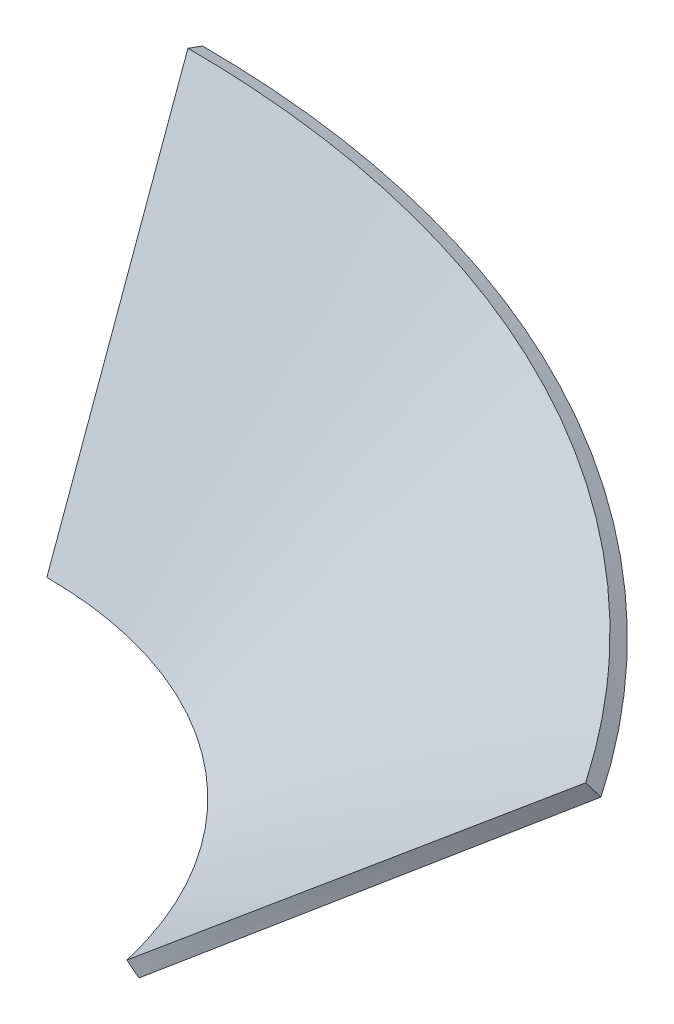
ISO-10303-21;
HEADER;
FILE_DESCRIPTION(('STEP AP214'),'2;1');
FILE_NAME('part.step','',(''),(''),'','','');
FILE_SCHEMA(('AUTOMOTIVE_DESIGN { 1 0 10303 214 1 1 1 1 }'));
ENDSEC;
DATA;
#1=APPLICATION_CONTEXT('core data for automotive mechanical design processes');
#2=APPLICATION_PROTOCOL_DEFINITION('international standard','automotive_design',2000,#1);
#3=PRODUCT_CONTEXT('',#1,'mechanical');
#4=PRODUCT('Part','Part','',(#3));
#5=PRODUCT_RELATED_PRODUCT_CATEGORY('part','',(#4));
#6=PRODUCT_DEFINITION_FORMATION('','',#4);
#7=PRODUCT_DEFINITION_CONTEXT('part definition',#1,'design');
#8=PRODUCT_DEFINITION('design','',#6,#7);
#9=PRODUCT_DEFINITION_SHAPE('','',#8);
#10=(LENGTH_UNIT() NAMED_UNIT(*) SI_UNIT(.MILLI.,.METRE.));
#11=(NAMED_UNIT(*) PLANE_ANGLE_UNIT() SI_UNIT($,.RADIAN.));
#12=(NAMED_UNIT(*) SI_UNIT($,.STERADIAN.) SOLID_ANGLE_UNIT());
#13=UNCERTAINTY_MEASURE_WITH_UNIT(LENGTH_MEASURE(1.E-05),#10,'distance_accuracy_value','');
#14=(GEOMETRIC_REPRESENTATION_CONTEXT(3) GLOBAL_UNCERTAINTY_ASSIGNED_CONTEXT((#13)) GLOBAL_UNIT_ASSIGNED_CONTEXT((#10,
#11,#12)) REPRESENTATION_CONTEXT('',''));
#15=CARTESIAN_POINT('',(0.,0.,0.));
#16=DIRECTION('',(0.,0.,1.));
#17=DIRECTION('',(1.,0.,0.));
#18=AXIS2_PLACEMENT_3D('',#15,#16,#17);
#19=CARTESIAN_POINT('',(0.,50.6840402866513,-16.3191264717385));
#20=CARTESIAN_POINT('',(10.8249010336155,50.6840402866513,-16.3191264717385));
#21=CARTESIAN_POINT('',(21.4731444882357,50.7087398383172,-14.98420988039));
#22=CARTESIAN_POINT('',(42.0120517760367,50.7974050081395,-9.86590466604726));
#23=CARTESIAN_POINT('',(51.9027896338999,50.8611717021922,-6.08275534195021));
#24=CARTESIAN_POINT('',(70.5197720273292,51.008107385866,3.71618677035024));
#25=CARTESIAN_POINT('',(79.2463289842847,51.0909703596056,9.73194356780101));
#26=CARTESIAN_POINT('',(95.1198683638577,51.2540069229055,23.7920880772626));
#27=CARTESIAN_POINT('',(102.266838470099,51.3338990721079,31.8367740876005));
#28=CARTESIAN_POINT('',(108.408596103571,51.4051770282457,40.7970191702065));
#29=CARTESIAN_POINT('',(0.,50.,-18.1985117133104));
#30=CARTESIAN_POINT('',(10.9805005193952,50.,-18.1985117133104));
#31=CARTESIAN_POINT('',(21.7826504128399,50.,-16.8353798673282));
#32=CARTESIAN_POINT('',(42.6047021804095,50.,-11.6088467613317));
#33=CARTESIAN_POINT('',(52.6246040545343,50.,-7.74544550131745));
#34=CARTESIAN_POINT('',(71.4566130160449,50.,2.25563215481074));
#35=CARTESIAN_POINT('',(80.2687201034307,50.,8.39330855092469));
#36=CARTESIAN_POINT('',(96.2595927240442,50.,22.7169422013199));
#37=CARTESIAN_POINT('',(103.438358257272,50.,30.9028994556012));
#38=CARTESIAN_POINT('',(109.587679629711,50.,40.));
#39=B_SPLINE_SURFACE_WITH_KNOTS('',1,3,((#19,#20,#21,#22,#23,#24,#25,#26,#27,#28),(#29,#30,#31,
#32,#33,#34,#35,#36,#37,#38)),.UNSPECIFIED.,.F.,.F.,.F.,(2,2),(4,2,2,2,4),(0.,1.),(0.,0.25,0.5,
0.75,1.),.UNSPECIFIED.);
#40=CARTESIAN_POINT('',(109.587679629711,50.,40.));
#41=CARTESIAN_POINT('',(108.408596103571,51.4051770282457,40.7970191702065));
#42=B_SPLINE_CURVE_WITH_KNOTS('',1,(#40,#41),.UNSPECIFIED.,.F.,.F.,(2,2),(0.,1.),.UNSPECIFIED.);
#43=CARTESIAN_POINT('',(109.587679629711,50.,40.));
#44=VERTEX_POINT('',#43);
#45=CARTESIAN_POINT('',(108.408596103571,51.4051770282457,40.7970191702065));
#46=VERTEX_POINT('',#45);
#47=EDGE_CURVE('E14',#44,#46,#42,.T.);
#48=CARTESIAN_POINT('',(109.587679629711,50.,40.));
#49=CARTESIAN_POINT('',(103.438358257272,50.,30.9028994556012));
#50=CARTESIAN_POINT('',(96.2595927240442,50.,22.7169422013199));
#51=CARTESIAN_POINT('',(80.2687201034307,50.,8.39330855092469));
#52=CARTESIAN_POINT('',(71.4566130160449,50.,2.25563215481074));
#53=CARTESIAN_POINT('',(52.6246040545343,50.,-7.74544550131745));
#54=CARTESIAN_POINT('',(42.6047021804095,50.,-11.6088467613317));
#55=CARTESIAN_POINT('',(21.7826504128399,50.,-16.8353798673282));
#56=CARTESIAN_POINT('',(10.9805005193952,50.,-18.1985117133104));
#57=CARTESIAN_POINT('',(0.,50.,-18.1985117133104));
#58=B_SPLINE_CURVE_WITH_KNOTS('',3,(#48,#49,#50,#51,#52,#53,#54,#55,#56,#57),.UNSPECIFIED.,.F.,
.F.,(4,2,2,2,4),(0.,0.25,0.5,0.75,1.),.UNSPECIFIED.);
#59=CARTESIAN_POINT('',(0.,50.,-18.1985117133104));
#60=VERTEX_POINT('',#59);
#61=EDGE_CURVE('E291',#44,#60,#58,.T.);
#62=CARTESIAN_POINT('',(0.,50.,-18.1985117133104));
#63=CARTESIAN_POINT('',(0.,50.6840402866513,-16.3191264717385));
#64=B_SPLINE_CURVE_WITH_KNOTS('',1,(#62,#63),.UNSPECIFIED.,.F.,.F.,(2,2),(0.,1.),.UNSPECIFIED.);
#65=CARTESIAN_POINT('',(0.,50.6840402866513,-16.3191264717385));
#66=VERTEX_POINT('',#65);
#67=EDGE_CURVE('E131',#60,#66,#64,.T.);
#68=CARTESIAN_POINT('',(108.408596103612,51.4051770282808,40.7970191702044));
#69=CARTESIAN_POINT('',(107.642493701793,51.3962866029761,39.6793294914557));
#70=CARTESIAN_POINT('',(106.859083840726,51.3872492616663,38.5735036334233));
#71=CARTESIAN_POINT('',(105.261549017149,51.3689368143863,36.3909415085314));
#72=CARTESIAN_POINT('',(104.447556978182,51.3596627833626,35.3141079361718));
#73=CARTESIAN_POINT('',(102.789714737203,51.340896683181,33.1899225499919));
#74=CARTESIAN_POINT('',(101.945982841247,51.3314055212837,32.1424783950681));
#75=CARTESIAN_POINT('',(100.22952635644,51.3122287816158,30.0774537208072));
#76=CARTESIAN_POINT('',(99.3569064601574,51.3025439475004,29.0597861721035));
#77=CARTESIAN_POINT('',(97.5835311517734,51.2830060847677,27.0546975675129));
#78=CARTESIAN_POINT('',(96.6828678444235,51.2731536468438,26.0671950435887));
#79=CARTESIAN_POINT('',(94.8542588839716,51.2533096212125,24.1228179908055));
#80=CARTESIAN_POINT('',(93.9263937128914,51.2433184825531,23.1658677656035));
#81=CARTESIAN_POINT('',(92.0442289178988,51.2232286864445,21.2829767485833));
#82=CARTESIAN_POINT('',(91.0899990726401,51.2131303495855,20.3569662000434));
#83=CARTESIAN_POINT('',(89.155947869647,51.1928602075425,18.5363362441779));
#84=CARTESIAN_POINT('',(88.1761864536979,51.182688609001,17.6416531569898));
#85=CARTESIAN_POINT('',(86.1919099552839,51.1623081785418,15.8840606001643));
#86=CARTESIAN_POINT('',(85.187445791534,51.1520994550204,15.0210936421963));
#87=CARTESIAN_POINT('',(83.1545970693339,51.131682937611,13.3273172492666));
#88=CARTESIAN_POINT('',(82.1262551664227,51.1214751705288,12.4964566176722));
#89=CARTESIAN_POINT('',(80.0464783808654,51.10110035692,10.8672778672928));
#90=CARTESIAN_POINT('',(78.9950786006728,51.0909332730472,10.0689149388153));
#91=CARTESIAN_POINT('',(76.8700132250174,51.0706809804754,8.50512091057467));
#92=CARTESIAN_POINT('',(75.796375831708,51.0605956882382,7.73965148084996));
#93=CARTESIAN_POINT('',(73.6276423665441,51.0405490129432,6.24202769694511));
#94=CARTESIAN_POINT('',(72.5325682245674,51.0305875187185,5.50984160575257));
#95=CARTESIAN_POINT('',(70.3218233686709,51.0108316253207,4.07920179827513));
#96=CARTESIAN_POINT('',(69.2061688300362,51.0010371056647,3.3807230304532));
#97=CARTESIAN_POINT('',(65.8301915424611,50.9719747857555,1.3368981721529));
#98=CARTESIAN_POINT('',(63.5390885778453,50.9530117778792,0.0419439207716497));
#99=CARTESIAN_POINT('',(58.8840036425009,50.9162714976767,-2.40823323566903));
#100=CARTESIAN_POINT('',(56.5200384015357,50.8984939560803,-3.56348792133414));
#101=CARTESIAN_POINT('',(52.9252660792756,50.8729745113279,-5.18878736742528));
#102=CARTESIAN_POINT('',(51.7185804032817,50.8646573451935,-5.71273447094463));
#103=CARTESIAN_POINT('',(49.2893701164254,50.8484428722183,-6.72452077306523));
#104=CARTESIAN_POINT('',(48.0668374837659,50.8405457892419,-7.21234077259512));
#105=CARTESIAN_POINT('',(45.6067775540441,50.8252109095451,-8.15143716497114));
#106=CARTESIAN_POINT('',(44.3692397299568,50.8177734606113,-8.60268596433854));
#107=CARTESIAN_POINT('',(41.8799532328885,50.8033951645828,-9.46823286127362));
#108=CARTESIAN_POINT('',(40.6281919079135,50.7964548075692,-9.88249458997304));
#109=CARTESIAN_POINT('',(38.1112568184473,50.7831063870632,-10.6736502369192));
#110=CARTESIAN_POINT('',(36.846068718649,50.7766989745819,-11.0504985589935));
#111=CARTESIAN_POINT('',(34.3030731208525,50.7644501407989,-11.7664110110048));
#112=CARTESIAN_POINT('',(33.0252500467428,50.7586095496136,-12.1054198303816));
#113=CARTESIAN_POINT('',(30.4577776207984,50.7475259352335,-12.7452351313866));
#114=CARTESIAN_POINT('',(29.1681119267897,50.7422839390502,-13.0459760547495));
#115=CARTESIAN_POINT('',(26.5777460184062,50.7324267881362,-13.6088367154021));
#116=CARTESIAN_POINT('',(25.2770292021316,50.7278128744439,-13.8708800737325));
#117=CARTESIAN_POINT('',(22.6653517803438,50.7192386948901,-14.3559261065373));
#118=CARTESIAN_POINT('',(21.3543748609262,50.7152799003261,-14.5788409707147));
#119=CARTESIAN_POINT('',(18.7229667232198,50.70804011845,-14.985210272498));
#120=CARTESIAN_POINT('',(17.4025200742151,50.7047608476546,-15.1685648254243));
#121=CARTESIAN_POINT('',(14.7529606243396,50.6989014768166,-15.4953933301446));
#122=CARTESIAN_POINT('',(13.4238339254265,50.6963233518649,-15.6387546517599));
#123=CARTESIAN_POINT('',(10.757700901943,50.6918845352134,-15.88517765159));
#124=CARTESIAN_POINT('',(9.42068292135157,50.6900260879934,-15.988113266898));
#125=CARTESIAN_POINT('',(6.73955231803689,50.6870420168321,-16.1532617329687));
#126=CARTESIAN_POINT('',(5.39543105693418,50.6859189161373,-16.215334371636));
#127=CARTESIAN_POINT('',(2.7008759843129,50.6844162184216,-16.2983495366273));
#128=CARTESIAN_POINT('',(1.35043739335836,50.6840394235203,-16.3191370524141));
#129=CARTESIAN_POINT('',(-2.92906408430304E-11,50.6840402866726,-16.3191264717463));
#130=B_SPLINE_CURVE_WITH_KNOTS('',3,(#68,#69,#70,#71,#72,#73,#74,#75,#76,#77,#78,#79,#80,#81,
#82,#83,#84,#85,#86,#87,#88,#89,#90,#91,#92,#93,#94,#95,#96,#97,#98,#99,#100,#101,#102,#103,
#104,#105,#106,#107,#108,#109,#110,#111,#112,#113,#114,#115,#116,#117,#118,#119,#120,#121,#122,
#123,#124,#125,#126,#127,#128,#129),.UNSPECIFIED.,.F.,.F.,(4,2,2,2,2,2,2,2,2,2,2,2,2,2,2,2,2,2,
2,2,2,2,2,2,2,2,2,2,2,2,4),(0.,4.06505632475749,8.11412446539964,12.1485856613322,
16.1697531644856,20.1788758898483,24.1771423312572,28.1656847185517,32.145583395111,
36.1178713955705,40.0835392020736,44.0435396626892,47.9987930496999,51.9501922412059,
55.8986080102557,63.7890098883885,71.6776133687218,75.6237799389633,79.5720287966563,
83.523229453428,87.4782734403303,91.4380797958748,95.4036004860255,99.375825735169,
103.355789245037,107.344573278378,111.343313581279,115.35320411797,119.375501590463,
123.41152971276,127.462683210241),.UNSPECIFIED.);
#131=EDGE_CURVE('E182',#46,#66,#130,.T.);
#132=ORIENTED_EDGE('',*,*,#47,.F.);
#133=ORIENTED_EDGE('',*,*,#61,.T.);
#134=ORIENTED_EDGE('',*,*,#67,.T.);
#135=ORIENTED_EDGE('',*,*,#131,.F.);
#136=EDGE_LOOP('',(#132,#133,#134,#135));
#137=FACE_BOUND('',#136,.T.);
#138=ADVANCED_FACE('F119',(#137),#39,.F.);
#139=CARTESIAN_POINT('',(0.,50.6840402866513,-16.3191264717385));
#140=DIRECTION('',(-1.,0.,0.));
#141=DIRECTION('',(0.,-0.342020143325672,-0.939692620785907));
#142=AXIS2_PLACEMENT_3D('',#139,#140,#141);
#143=PLANE('',#142);
#144=ORIENTED_EDGE('',*,*,#67,.F.);
#145=CARTESIAN_POINT('',(0.,0.,0.));
#146=CARTESIAN_POINT('',(0.,50.,-18.1985117133104));
#147=B_SPLINE_CURVE_WITH_KNOTS('',1,(#145,#146),.UNSPECIFIED.,.F.,.F.,(2,2),(0.,1.),.UNSPECIFIED.);
#148=CARTESIAN_POINT('',(0.,0.,0.));
#149=VERTEX_POINT('',#148);
#150=EDGE_CURVE('E165',#60,#149,#147,.F.);
#151=ORIENTED_EDGE('',*,*,#150,.T.);
#152=CARTESIAN_POINT('',(0.,0.684040286651346,1.87938524157181));
#153=CARTESIAN_POINT('',(0.,0.,0.));
#154=B_SPLINE_CURVE_WITH_KNOTS('',1,(#152,#153),.UNSPECIFIED.,.F.,.F.,(2,2),(0.,1.),.UNSPECIFIED.);
#155=CARTESIAN_POINT('',(0.,0.684040286651346,1.87938524157181));
#156=VERTEX_POINT('',#155);
#157=EDGE_CURVE('E161',#149,#156,#154,.F.);
#158=ORIENTED_EDGE('',*,*,#157,.T.);
#159=CARTESIAN_POINT('',(-2.92906408430304E-11,50.6840402866726,-16.3191264717463));
#160=CARTESIAN_POINT('',(2.43389383129165E-11,48.6007069533445,-15.5608551503602));
#161=CARTESIAN_POINT('',(3.00946519682249E-11,46.5173736200164,-14.8025838289742));
#162=CARTESIAN_POINT('',(8.0969746176071E-12,42.3507069533217,-13.2860411861882));
#163=CARTESIAN_POINT('',(-1.96564163889365E-11,40.2673736199553,-12.5277698647882));
#164=CARTESIAN_POINT('',(-4.64336767203023E-11,36.1007069532694,-11.0112272220053));
#165=CARTESIAN_POINT('',(-4.54575460457745E-11,34.01737361995,-10.2529559006225));
#166=CARTESIAN_POINT('',(-3.32725001383884E-11,29.8507069533043,-8.73641325785424));
#167=CARTESIAN_POINT('',(-2.20635849054959E-11,27.767373619978,-7.97814193646885));
#168=CARTESIAN_POINT('',(-1.58398329544504E-11,23.6007069533183,-6.46159929369553));
#169=CARTESIAN_POINT('',(-2.08249962363517E-11,21.517373619985,-5.7033279723076));
#170=CARTESIAN_POINT('',(-2.00858313777983E-11,17.3507069533218,-4.18678532953301));
#171=CARTESIAN_POINT('',(-1.43615032373615E-11,15.2673736199919,-3.42851400814635));
#172=CARTESIAN_POINT('',(-7.85680020585296E-12,11.1007069533253,-1.91197136537049));
#173=CARTESIAN_POINT('',(-7.07642531479777E-12,9.01737361998845,-1.15370004398128));
#174=CARTESIAN_POINT('',(-5.08042912703093E-12,4.85070695331819,0.362842598795886));
#175=CARTESIAN_POINT('',(-3.86480783031998E-12,2.76737361998477,1.12111392018385));
#176=CARTESIAN_POINT('',(2.58036496739734E-13,0.684040286651345,1.87938524157181));
#177=B_SPLINE_CURVE_WITH_KNOTS('',3,(#159,#160,#161,#162,#163,#164,#165,#166,#167,#168,#169,
#170,#171,#172,#173,#174,#175,#176),.UNSPECIFIED.,.F.,.F.,(4,2,2,2,2,2,2,2,4),(0.,
6.65111107795779,13.3022221560381,19.953333233968,26.6044443119202,33.2555553898946,
39.9066664678579,46.5577775458435,53.2088886238183),.UNSPECIFIED.);
#178=EDGE_CURVE('E164',#66,#156,#177,.T.);
#179=ORIENTED_EDGE('',*,*,#178,.F.);
#180=EDGE_LOOP('',(#144,#151,#158,#179));
#181=FACE_BOUND('',#180,.T.);
#182=ADVANCED_FACE('F121',(#181),#143,.T.);
#183=CARTESIAN_POINT('',(0.,0.684040286651346,1.87938524157181));
#184=CARTESIAN_POINT('',(5.77265199535576,0.684040286651346,1.87938524157181));
#185=CARTESIAN_POINT('',(11.3497534668203,0.720019055685617,2.86709290837386));
#186=CARTESIAN_POINT('',(21.7775940697326,0.843055199080425,6.52660243017407));
#187=CARTESIAN_POINT('',(26.628867837651,0.92920837619734,9.19847023848127));
#188=CARTESIAN_POINT('',(35.2483765429995,1.11223542366804,15.9549742857055));
#189=CARTESIAN_POINT('',(39.0167795586966,1.20831806684802,20.0402428612955));
#190=CARTESIAN_POINT('',(45.0811361582107,1.37980264049407,29.3647636380504));
#191=CARTESIAN_POINT('',(47.3763485009201,1.45514674117948,34.6044111629637));
#192=CARTESIAN_POINT('',(48.727662673858,1.5163125794214,40.2862758983819));
#193=CARTESIAN_POINT('',(0.,0.,0.));
#194=CARTESIAN_POINT('',(5.99031188382215,0.,0.));
#195=CARTESIAN_POINT('',(11.7817311979625,0.,1.03894832101899));
#196=CARTESIAN_POINT('',(22.581256584969,0.,4.88631912356645));
#197=CARTESIAN_POINT('',(27.5893626578351,0.,7.69474160509493));
#198=CARTESIAN_POINT('',(36.4367334603826,0.,14.7726382471329));
#199=CARTESIAN_POINT('',(40.2759981900639,0.,19.0421124076424));
#200=CARTESIAN_POINT('',(46.4001582043312,0.,28.7336899261139));
#201=CARTESIAN_POINT('',(48.6850534889171,0.,34.1557932840759));
#202=CARTESIAN_POINT('',(50.,0.,40.));
#203=B_SPLINE_SURFACE_WITH_KNOTS('',1,3,((#183,#184,#185,#186,#187,#188,#189,#190,#191,#192),
(#193,#194,#195,#196,#197,#198,#199,#200,#201,#202)),.UNSPECIFIED.,.F.,.F.,.F.,(2,2),(4,2,2,2,
4),(0.,1.),(0.,0.25,0.5,0.75,1.),.UNSPECIFIED.);
#204=CARTESIAN_POINT('',(0.,0.,0.));
#205=CARTESIAN_POINT('',(5.99031188382215,0.,0.));
#206=CARTESIAN_POINT('',(11.7817311979625,0.,1.03894832101899));
#207=CARTESIAN_POINT('',(22.581256584969,0.,4.88631912356645));
#208=CARTESIAN_POINT('',(27.5893626578351,0.,7.69474160509493));
#209=CARTESIAN_POINT('',(36.4367334603826,0.,14.7726382471329));
#210=CARTESIAN_POINT('',(40.2759981900639,0.,19.0421124076424));
#211=CARTESIAN_POINT('',(46.4001582043312,0.,28.7336899261139));
#212=CARTESIAN_POINT('',(48.6850534889171,0.,34.1557932840759));
#213=CARTESIAN_POINT('',(50.,0.,40.));
#214=B_SPLINE_CURVE_WITH_KNOTS('',3,(#204,#205,#206,#207,#208,#209,#210,#211,#212,#213),
.UNSPECIFIED.,.F.,.F.,(4,2,2,2,4),(0.,0.25,0.5,0.75,1.),.UNSPECIFIED.);
#215=CARTESIAN_POINT('',(50.,0.,40.));
#216=VERTEX_POINT('',#215);
#217=EDGE_CURVE('E184',#149,#216,#214,.T.);
#218=CARTESIAN_POINT('',(50.,0.,40.));
#219=CARTESIAN_POINT('',(48.727662673858,1.5163125794214,40.2862758983819));
#220=B_SPLINE_CURVE_WITH_KNOTS('',1,(#218,#219),.UNSPECIFIED.,.F.,.F.,(2,2),(0.,1.),.UNSPECIFIED.);
#221=CARTESIAN_POINT('',(48.727662673858,1.5163125794214,40.2862758983819));
#222=VERTEX_POINT('',#221);
#223=EDGE_CURVE('E172',#216,#222,#220,.T.);
#224=CARTESIAN_POINT('',(2.58036496739734E-13,0.684040286651345,1.87938524157181));
#225=CARTESIAN_POINT('',(0.718656127822375,0.684037843397547,1.8793665670023));
#226=CARTESIAN_POINT('',(1.43731764671445,0.684576075846765,1.894705938729));
#227=CARTESIAN_POINT('',(2.86783111001728,0.686729872183305,1.95592623401847));
#228=CARTESIAN_POINT('',(3.57969311060006,0.688337168384155,2.00157277003933));
#229=CARTESIAN_POINT('',(4.99596500150211,0.6926103332833,2.12281725651599));
#230=CARTESIAN_POINT('',(5.70039258938772,0.695268900396044,2.1982086068805));
#231=CARTESIAN_POINT('',(7.10114623671469,0.701613043925287,2.37833259999444));
#232=CARTESIAN_POINT('',(7.79749552468349,0.705292304870329,2.48288483259591));
#233=CARTESIAN_POINT('',(9.18144073896021,0.713638873681131,2.72073530391824));
#234=CARTESIAN_POINT('',(9.8690635371066,0.718300811552714,2.85387738003853));
#235=CARTESIAN_POINT('',(11.2348999280601,0.728565958815836,3.14831740540459));
#236=CARTESIAN_POINT('',(11.9131424088435,0.734164689415358,3.30948151883311));
#237=CARTESIAN_POINT('',(13.2595583830569,0.746249978961744,3.65938288300763));
#238=CARTESIAN_POINT('',(13.9277613902097,0.752732878954333,3.84800670362935));
#239=CARTESIAN_POINT('',(15.2534343440237,0.766527134727713,4.25225133349862));
#240=CARTESIAN_POINT('',(15.9109332582027,0.773835570580936,4.46777725738106));
#241=CARTESIAN_POINT('',(17.2145294066216,0.789216444961364,4.92525661104424));
#242=CARTESIAN_POINT('',(17.8606540821857,0.797286616392437,5.16713193087887));
#243=CARTESIAN_POINT('',(19.1408282707973,0.81412225095021,5.67674714213662));
#244=CARTESIAN_POINT('',(19.7749028815775,0.822886012040733,5.94442404949175));
#245=CARTESIAN_POINT('',(21.0302982497305,0.841036691927374,6.50508598513586));
#246=CARTESIAN_POINT('',(21.6516410748401,0.850422387183509,6.7980216447616));
#247=CARTESIAN_POINT('',(22.8808885925792,0.869742217650611,7.40865100116255));
#248=CARTESIAN_POINT('',(23.4888117351336,0.879675524461409,7.72630758558814));
#249=CARTESIAN_POINT('',(24.6905296196912,0.900014122509481,8.38583489908054));
#250=CARTESIAN_POINT('',(25.2843386723037,0.910418901607551,8.72767957018087));
#251=CARTESIAN_POINT('',(26.457131714502,0.931623101219513,9.43504509369393));
#252=CARTESIAN_POINT('',(27.0361253887745,0.942422252115419,9.80054989786066));
#253=CARTESIAN_POINT('',(28.1785842292162,0.964337812824795,10.5547032912769));
#254=CARTESIAN_POINT('',(28.7420539723663,0.975454127116863,10.9433449498319));
#255=CARTESIAN_POINT('',(29.8527543750948,0.997927431618464,11.7432447502487));
#256=CARTESIAN_POINT('',(30.3999839986306,1.00928443710407,12.1545043302718));
#257=CARTESIAN_POINT('',(31.4774861738852,1.03216415737444,12.9991171834383));
#258=CARTESIAN_POINT('',(32.0077515212097,1.04368693962724,13.4324796457704));
#259=CARTESIAN_POINT('',(33.050599548472,1.06682564705209,14.3207792959992));
#260=CARTESIAN_POINT('',(33.5631682259667,1.07844163740719,14.7757329212969));
#261=CARTESIAN_POINT('',(34.5698896234644,1.10169732829483,15.7066989722755));
#262=CARTESIAN_POINT('',(35.064020816796,1.11333704077922,16.1827346770496));
#263=CARTESIAN_POINT('',(36.0331262983066,1.13657454868265,17.1553511500712));
#264=CARTESIAN_POINT('',(36.5080706932989,1.14817225486531,17.6519617074673));
#265=CARTESIAN_POINT('',(37.4380541419327,1.17126452162816,18.665215433881));
#266=CARTESIAN_POINT('',(37.8930539606991,1.18275884639547,19.1818946213319));
#267=CARTESIAN_POINT('',(38.7823926392124,1.20558802500476,20.2347735163805));
#268=CARTESIAN_POINT('',(39.2166818007631,1.21692245339458,20.7710152153474));
#269=CARTESIAN_POINT('',(40.0638368059167,1.23938082263201,21.8625064841295));
#270=CARTESIAN_POINT('',(40.4766412102356,1.25050410761385,22.4178037574526));
#271=CARTESIAN_POINT('',(41.2800581674129,1.2724947812428,23.546892087397));
#272=CARTESIAN_POINT('',(41.6705961007857,1.28336124530213,24.1207362634522));
#273=CARTESIAN_POINT('',(42.4287060808266,1.30479866781562,25.2864020563772));
#274=CARTESIAN_POINT('',(42.7961887275109,1.3153683975102,25.8782818441472));
#275=CARTESIAN_POINT('',(43.5074093763234,1.33617862464765,27.0794995350841));
#276=CARTESIAN_POINT('',(43.8510414428657,1.34641755713818,27.6889001938408));
#277=CARTESIAN_POINT('',(44.5137782352475,1.36653832271125,28.924636707174));
#278=CARTESIAN_POINT('',(44.8327585930944,1.37641822675844,29.5510392984024));
#279=CARTESIAN_POINT('',(45.4454063887927,1.39579881771013,30.8202526518674));
#280=CARTESIAN_POINT('',(45.7389290099923,1.40529718858339,31.4631333572455));
#281=CARTESIAN_POINT('',(46.2998730670043,1.42389810704319,32.7647715332064));
#282=CARTESIAN_POINT('',(46.5671271264812,1.43299793426509,33.4236011764113));
#283=CARTESIAN_POINT('',(47.0747465643672,1.45079051061699,34.7566009324253));
#284=CARTESIAN_POINT('',(47.314919859075,1.45948012500437,35.4308442370887));
#285=CARTESIAN_POINT('',(47.7675821114079,1.47644556779066,36.7941311673602));
#286=CARTESIAN_POINT('',(47.9798520556126,1.48471784100715,37.4832475470028));
#287=CARTESIAN_POINT('',(48.3759413367439,1.500847778508,38.8757324862057));
#288=CARTESIAN_POINT('',(48.5595128403826,1.50870148219968,39.5791716019201));
#289=CARTESIAN_POINT('',(48.7276626739143,1.51631257947097,40.2862758983693));
#290=B_SPLINE_CURVE_WITH_KNOTS('',3,(#224,#225,#226,#227,#228,#229,#230,#231,#232,#233,#234,
#235,#236,#237,#238,#239,#240,#241,#242,#243,#244,#245,#246,#247,#248,#249,#250,#251,#252,#253,
#254,#255,#256,#257,#258,#259,#260,#261,#262,#263,#264,#265,#266,#267,#268,#269,#270,#271,#272,
#273,#274,#275,#276,#277,#278,#279,#280,#281,#282,#283,#284,#285,#286,#287,#288,#289),
.UNSPECIFIED.,.F.,.F.,(4,2,2,2,2,2,2,2,2,2,2,2,2,2,2,2,2,2,2,2,2,2,2,2,2,2,2,2,2,2,2,2,4),(0.,
2.15581140850244,4.29514157904886,6.41986694174353,8.53172817757314,10.6323348780923,
12.7231714604359,14.8056042097608,16.8808893159624,18.9501817708041,21.0145449966715,
23.0749610833967,25.1323415202145,27.1875383186595,29.2413554315334,31.2945603848674,
33.3478960426052,35.4020924381339,37.4578786028563,39.5159943316607,41.5772018242129,
43.6422971365625,45.712121384206,47.7875716216504,49.869611332541,51.9592804465711,
54.0577048038849,56.1661049764324,58.2858043556983,60.4182364135673,62.5649510423863,
64.7276198857366,66.9080405792042),.UNSPECIFIED.);
#291=EDGE_CURVE('E180',#156,#222,#290,.T.);
#292=ORIENTED_EDGE('',*,*,#157,.F.);
#293=ORIENTED_EDGE('',*,*,#217,.T.);
#294=ORIENTED_EDGE('',*,*,#223,.T.);
#295=ORIENTED_EDGE('',*,*,#291,.F.);
#296=EDGE_LOOP('',(#292,#293,#294,#295));
#297=FACE_BOUND('',#296,.T.);
#298=ADVANCED_FACE('F189',(#297),#203,.T.);
#299=CARTESIAN_POINT('',(48.727662673858,1.5163125794214,40.2862758983819));
#300=CARTESIAN_POINT('',(58.6724929931625,9.83348790572255,40.4320836492663));
#301=CARTESIAN_POINT('',(68.6221468410137,18.144933358092,40.5320389682422));
#302=CARTESIAN_POINT('',(88.5175035112296,34.7725143281061,40.6909294103179));
#303=CARTESIAN_POINT('',(98.4639399166113,43.0877834959382,40.7491282811069));
#304=CARTESIAN_POINT('',(108.408596103571,51.4051770282457,40.7970191702065));
#305=CARTESIAN_POINT('',(50.,0.,40.));
#306=CARTESIAN_POINT('',(59.9312799382852,8.33333333333333,40.));
#307=CARTESIAN_POINT('',(69.8625598765704,16.6666666666667,40.));
#308=CARTESIAN_POINT('',(89.7251197531408,33.3333333333333,40.));
#309=CARTESIAN_POINT('',(99.656399691426,41.6666666666667,40.));
#310=CARTESIAN_POINT('',(109.587679629711,50.,40.));
#311=B_SPLINE_SURFACE_WITH_KNOTS('',1,3,((#299,#300,#301,#302,#303,#304),(#305,#306,#307,#308,
#309,#310)),.UNSPECIFIED.,.F.,.F.,.F.,(2,2),(4,2,4),(0.,1.),(-0.0388930956715106,0.,
0.0388930956715106),.UNSPECIFIED.);
#312=CARTESIAN_POINT('',(50.,0.,40.));
#313=CARTESIAN_POINT('',(59.9312799382852,8.33333333333333,40.));
#314=CARTESIAN_POINT('',(69.8625598765704,16.6666666666667,40.));
#315=CARTESIAN_POINT('',(89.7251197531408,33.3333333333333,40.));
#316=CARTESIAN_POINT('',(99.656399691426,41.6666666666667,40.));
#317=CARTESIAN_POINT('',(109.587679629711,50.,40.));
#318=B_SPLINE_CURVE_WITH_KNOTS('',3,(#312,#313,#314,#315,#316,#317),.UNSPECIFIED.,.F.,.F.,(4,2,
4),(-0.0388930956715106,0.,0.0388930956715106),.UNSPECIFIED.);
#319=EDGE_CURVE('E285',#216,#44,#318,.T.);
#320=CARTESIAN_POINT('',(48.7276626739143,1.51631257947097,40.2862758983693));
#321=CARTESIAN_POINT('',(51.2138782594183,3.59555582414154,40.322696949744));
#322=CARTESIAN_POINT('',(53.7004436483574,5.67442923149166,40.3562051844759));
#323=CARTESIAN_POINT('',(58.6739481063054,9.83173071247573,40.4182973077898));
#324=CARTESIAN_POINT('',(61.1608871694673,11.9101587920482,40.4468812667244));
#325=CARTESIAN_POINT('',(66.1348587447437,16.0669021571516,40.5000268437725));
#326=CARTESIAN_POINT('',(68.6218912556462,18.1452174436167,40.524588502911));
#327=CARTESIAN_POINT('',(73.5959108735059,22.3019015335691,40.5703866006483));
#328=CARTESIAN_POINT('',(76.0828979806625,24.3802703365498,40.5916230637246));
#329=CARTESIAN_POINT('',(81.0567389965821,28.5371661714766,40.6313452080069));
#330=CARTESIAN_POINT('',(83.5435929059896,30.6156932025116,40.6498309040065));
#331=CARTESIAN_POINT('',(88.5171221371543,34.7729597873231,40.6845108304305));
#332=CARTESIAN_POINT('',(91.0037974595828,36.8516993402211,40.7007050699726));
#333=CARTESIAN_POINT('',(95.9769469588142,41.0094178896319,40.731177422009));
#334=CARTESIAN_POINT('',(98.4634211361948,43.0883968854125,40.7454555402156));
#335=CARTESIAN_POINT('',(103.436163433203,47.2466004470624,40.77238504702));
#336=CARTESIAN_POINT('',(105.922431553283,49.3258250123659,40.7850364392959));
#337=CARTESIAN_POINT('',(108.408596103612,51.4051770282808,40.7970191702044));
#338=B_SPLINE_CURVE_WITH_KNOTS('',3,(#320,#321,#322,#323,#324,#325,#326,#327,#328,#329,#330,
#331,#332,#333,#334,#335,#336,#337),.UNSPECIFIED.,.F.,.F.,(4,2,2,2,2,2,2,2,4),(0.,
9.72381352487097,19.4474881150273,29.1710635234356,38.8945673514819,48.6180188845519,
58.3414317265433,68.0648155803083,77.7881774487482),.UNSPECIFIED.);
#339=EDGE_CURVE('E192',#222,#46,#338,.T.);
#340=ORIENTED_EDGE('',*,*,#319,.T.);
#341=ORIENTED_EDGE('',*,*,#47,.T.);
#342=ORIENTED_EDGE('',*,*,#339,.F.);
#343=ORIENTED_EDGE('',*,*,#223,.F.);
#344=EDGE_LOOP('',(#340,#341,#342,#343));
#345=FACE_BOUND('',#344,.T.);
#346=ADVANCED_FACE('F213',(#345),#311,.T.);
#347=CARTESIAN_POINT('',(0.,0.,0.));
#348=CARTESIAN_POINT('',(0.,50.,-18.1985117133104));
#349=CARTESIAN_POINT('',(23.9612475352886,0.,0.));
#350=CARTESIAN_POINT('',(43.9220020775808,50.,-18.1985117133104));
#351=CARTESIAN_POINT('',(44.7402139556684,0.,16.6231731363038));
#352=CARTESIAN_POINT('',(84.9903941399543,50.,3.61159782240487));
#353=CARTESIAN_POINT('',(50.,0.,40.));
#354=CARTESIAN_POINT('',(109.587679629711,50.,40.));
#355=B_SPLINE_SURFACE_WITH_KNOTS('',3,1,((#347,#348),(#349,#350),(#351,#352),(#353,#354)),
.UNSPECIFIED.,.F.,.F.,.F.,(4,4),(2,2),(0.,1.),(0.,1.),.UNSPECIFIED.);
#356=OFFSET_SURFACE('',#355,2.,.F.);
#357=ORIENTED_EDGE('',*,*,#291,.T.);
#358=ORIENTED_EDGE('',*,*,#339,.T.);
#359=ORIENTED_EDGE('',*,*,#131,.T.);
#360=ORIENTED_EDGE('',*,*,#178,.T.);
#361=EDGE_LOOP('',(#357,#358,#359,#360));
#362=FACE_BOUND('',#361,.T.);
#363=ADVANCED_FACE('F178',(#362),#356,.T.);
#364=CARTESIAN_POINT('',(0.,0.,0.));
#365=CARTESIAN_POINT('',(0.,50.,-18.1985117133104));
#366=CARTESIAN_POINT('',(23.9612475352886,0.,0.));
#367=CARTESIAN_POINT('',(43.9220020775808,50.,-18.1985117133104));
#368=CARTESIAN_POINT('',(44.7402139556684,0.,16.6231731363038));
#369=CARTESIAN_POINT('',(84.9903941399543,50.,3.61159782240487));
#370=CARTESIAN_POINT('',(50.,0.,40.));
#371=CARTESIAN_POINT('',(109.587679629711,50.,40.));
#372=B_SPLINE_SURFACE_WITH_KNOTS('',3,1,((#364,#365),(#366,#367),(#368,#369),(#370,#371)),
.UNSPECIFIED.,.F.,.F.,.F.,(4,4),(2,2),(0.,1.),(0.,1.),.UNSPECIFIED.);
#373=ORIENTED_EDGE('',*,*,#217,.F.);
#374=ORIENTED_EDGE('',*,*,#150,.F.);
#375=ORIENTED_EDGE('',*,*,#61,.F.);
#376=ORIENTED_EDGE('',*,*,#319,.F.);
#377=EDGE_LOOP('',(#373,#374,#375,#376));
#378=FACE_BOUND('',#377,.T.);
#379=ADVANCED_FACE('F301',(#378),#372,.F.);
#380=CLOSED_SHELL('',(#138,#182,#298,#346,#363,#379));
#381=MANIFOLD_SOLID_BREP('B2',#380);
#382=ADVANCED_BREP_SHAPE_REPRESENTATION('',(#18,#381),#14);
#383=SHAPE_DEFINITION_REPRESENTATION(#9,#382);
ENDSEC;
END-ISO-10303-21;
